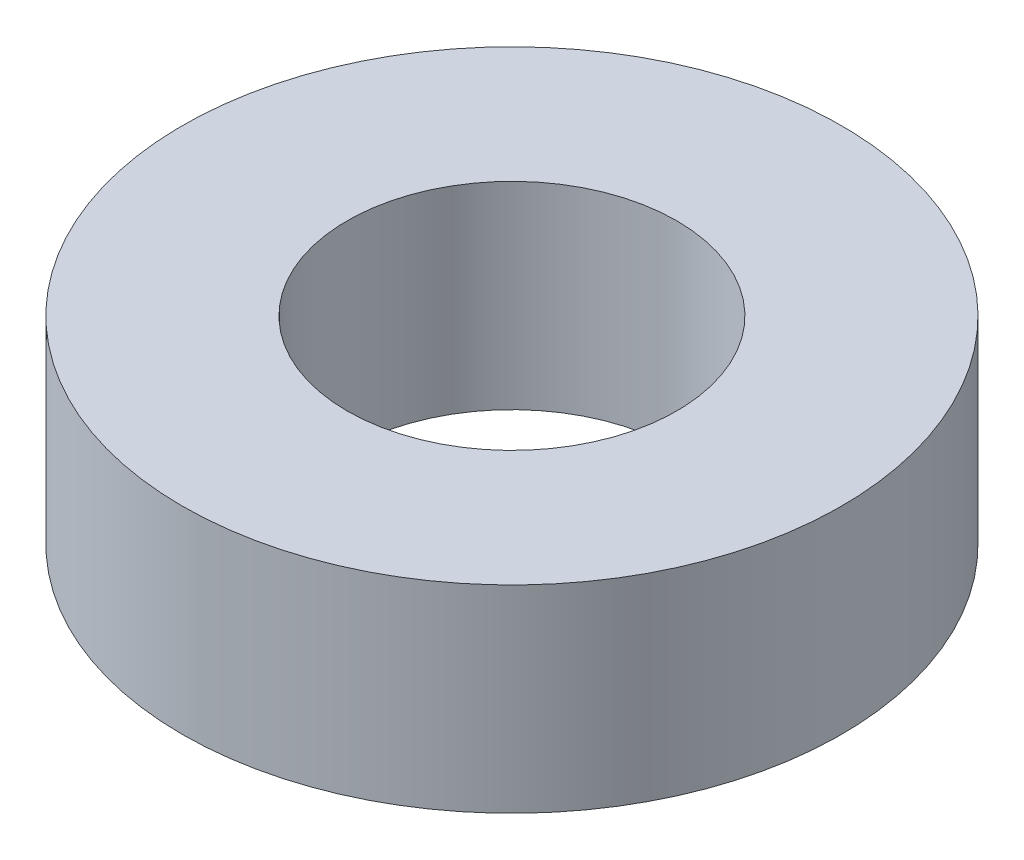
ISO-10303-21;
HEADER;
FILE_DESCRIPTION(('STEP AP214'),'2;1');
FILE_NAME('part.step','',(''),(''),'','','');
FILE_SCHEMA(('AUTOMOTIVE_DESIGN { 1 0 10303 214 1 1 1 1 }'));
ENDSEC;
DATA;
#1=APPLICATION_CONTEXT('core data for automotive mechanical design processes');
#2=APPLICATION_PROTOCOL_DEFINITION('international standard','automotive_design',2000,#1);
#3=PRODUCT_CONTEXT('',#1,'mechanical');
#4=PRODUCT('Part','Part','',(#3));
#5=PRODUCT_RELATED_PRODUCT_CATEGORY('part','',(#4));
#6=PRODUCT_DEFINITION_FORMATION('','',#4);
#7=PRODUCT_DEFINITION_CONTEXT('part definition',#1,'design');
#8=PRODUCT_DEFINITION('design','',#6,#7);
#9=PRODUCT_DEFINITION_SHAPE('','',#8);
#10=(LENGTH_UNIT() NAMED_UNIT(*) SI_UNIT(.MILLI.,.METRE.));
#11=(NAMED_UNIT(*) PLANE_ANGLE_UNIT() SI_UNIT($,.RADIAN.));
#12=(NAMED_UNIT(*) SI_UNIT($,.STERADIAN.) SOLID_ANGLE_UNIT());
#13=UNCERTAINTY_MEASURE_WITH_UNIT(LENGTH_MEASURE(1.E-05),#10,'distance_accuracy_value','');
#14=(GEOMETRIC_REPRESENTATION_CONTEXT(3) GLOBAL_UNCERTAINTY_ASSIGNED_CONTEXT((#13)) GLOBAL_UNIT_ASSIGNED_CONTEXT((#10,
#11,#12)) REPRESENTATION_CONTEXT('',''));
#15=CARTESIAN_POINT('',(0.,0.,0.));
#16=DIRECTION('',(0.,0.,1.));
#17=DIRECTION('',(1.,0.,0.));
#18=AXIS2_PLACEMENT_3D('',#15,#16,#17);
#19=CARTESIAN_POINT('',(0.,15.,0.));
#20=DIRECTION('',(0.,-1.,0.));
#21=DIRECTION('',(0.,0.,-1.));
#22=AXIS2_PLACEMENT_3D('',#19,#20,#21);
#23=CYLINDRICAL_SURFACE('',#22,25.);
#24=CARTESIAN_POINT('',(0.,15.,0.));
#25=DIRECTION('',(0.,1.,0.));
#26=DIRECTION('',(0.,0.,1.));
#27=AXIS2_PLACEMENT_3D('',#24,#25,#26);
#28=CIRCLE('',#27,25.);
#29=CARTESIAN_POINT('',(0.,15.,25.));
#30=VERTEX_POINT('',#29);
#31=EDGE_CURVE('E10',#30,#30,#28,.T.);
#32=ORIENTED_EDGE('',*,*,#31,.F.);
#33=EDGE_LOOP('',(#32));
#34=FACE_BOUND('',#33,.T.);
#35=CARTESIAN_POINT('',(0.,0.,0.));
#36=DIRECTION('',(0.,1.,0.));
#37=DIRECTION('',(0.,0.,1.));
#38=AXIS2_PLACEMENT_3D('',#35,#36,#37);
#39=CIRCLE('',#38,25.);
#40=CARTESIAN_POINT('',(0.,0.,25.));
#41=VERTEX_POINT('',#40);
#42=EDGE_CURVE('E37',#41,#41,#39,.T.);
#43=ORIENTED_EDGE('',*,*,#42,.T.);
#44=EDGE_LOOP('',(#43));
#45=FACE_BOUND('',#44,.T.);
#46=ADVANCED_FACE('F40',(#34,#45),#23,.T.);
#47=CARTESIAN_POINT('',(0.,15.,0.));
#48=DIRECTION('',(0.,1.,0.));
#49=DIRECTION('',(0.,0.,1.));
#50=AXIS2_PLACEMENT_3D('',#47,#48,#49);
#51=PLANE('',#50);
#52=CARTESIAN_POINT('',(0.,15.,0.));
#53=DIRECTION('',(0.,1.,0.));
#54=DIRECTION('',(0.,0.,1.));
#55=AXIS2_PLACEMENT_3D('',#52,#53,#54);
#56=CIRCLE('',#55,12.5);
#57=CARTESIAN_POINT('',(0.,15.,12.5));
#58=VERTEX_POINT('',#57);
#59=EDGE_CURVE('E50',#58,#58,#56,.T.);
#60=ORIENTED_EDGE('',*,*,#59,.F.);
#61=EDGE_LOOP('',(#60));
#62=FACE_BOUND('',#61,.T.);
#63=ORIENTED_EDGE('',*,*,#31,.T.);
#64=EDGE_LOOP('',(#63));
#65=FACE_BOUND('',#64,.T.);
#66=ADVANCED_FACE('F59',(#62,#65),#51,.T.);
#67=CARTESIAN_POINT('',(0.,0.,0.));
#68=DIRECTION('',(0.,1.,0.));
#69=DIRECTION('',(0.,0.,1.));
#70=AXIS2_PLACEMENT_3D('',#67,#68,#69);
#71=PLANE('',#70);
#72=CARTESIAN_POINT('',(0.,0.,0.));
#73=DIRECTION('',(0.,1.,0.));
#74=DIRECTION('',(0.,0.,1.));
#75=AXIS2_PLACEMENT_3D('',#72,#73,#74);
#76=CIRCLE('',#75,12.5);
#77=CARTESIAN_POINT('',(0.,0.,12.5));
#78=VERTEX_POINT('',#77);
#79=EDGE_CURVE('E47',#78,#78,#76,.T.);
#80=ORIENTED_EDGE('',*,*,#79,.T.);
#81=EDGE_LOOP('',(#80));
#82=FACE_BOUND('',#81,.T.);
#83=ORIENTED_EDGE('',*,*,#42,.F.);
#84=EDGE_LOOP('',(#83));
#85=FACE_BOUND('',#84,.T.);
#86=ADVANCED_FACE('F58',(#82,#85),#71,.F.);
#87=CARTESIAN_POINT('',(0.,15.,0.));
#88=DIRECTION('',(0.,-1.,0.));
#89=DIRECTION('',(0.,0.,-1.));
#90=AXIS2_PLACEMENT_3D('',#87,#88,#89);
#91=CYLINDRICAL_SURFACE('',#90,12.5);
#92=ORIENTED_EDGE('',*,*,#59,.T.);
#93=EDGE_LOOP('',(#92));
#94=FACE_BOUND('',#93,.T.);
#95=ORIENTED_EDGE('',*,*,#79,.F.);
#96=EDGE_LOOP('',(#95));
#97=FACE_BOUND('',#96,.T.);
#98=ADVANCED_FACE('F54',(#94,#97),#91,.F.);
#99=CLOSED_SHELL('',(#46,#66,#86,#98));
#100=MANIFOLD_SOLID_BREP('B2',#99);
#101=ADVANCED_BREP_SHAPE_REPRESENTATION('',(#18,#100),#14);
#102=SHAPE_DEFINITION_REPRESENTATION(#9,#101);
ENDSEC;
END-ISO-10303-21;
